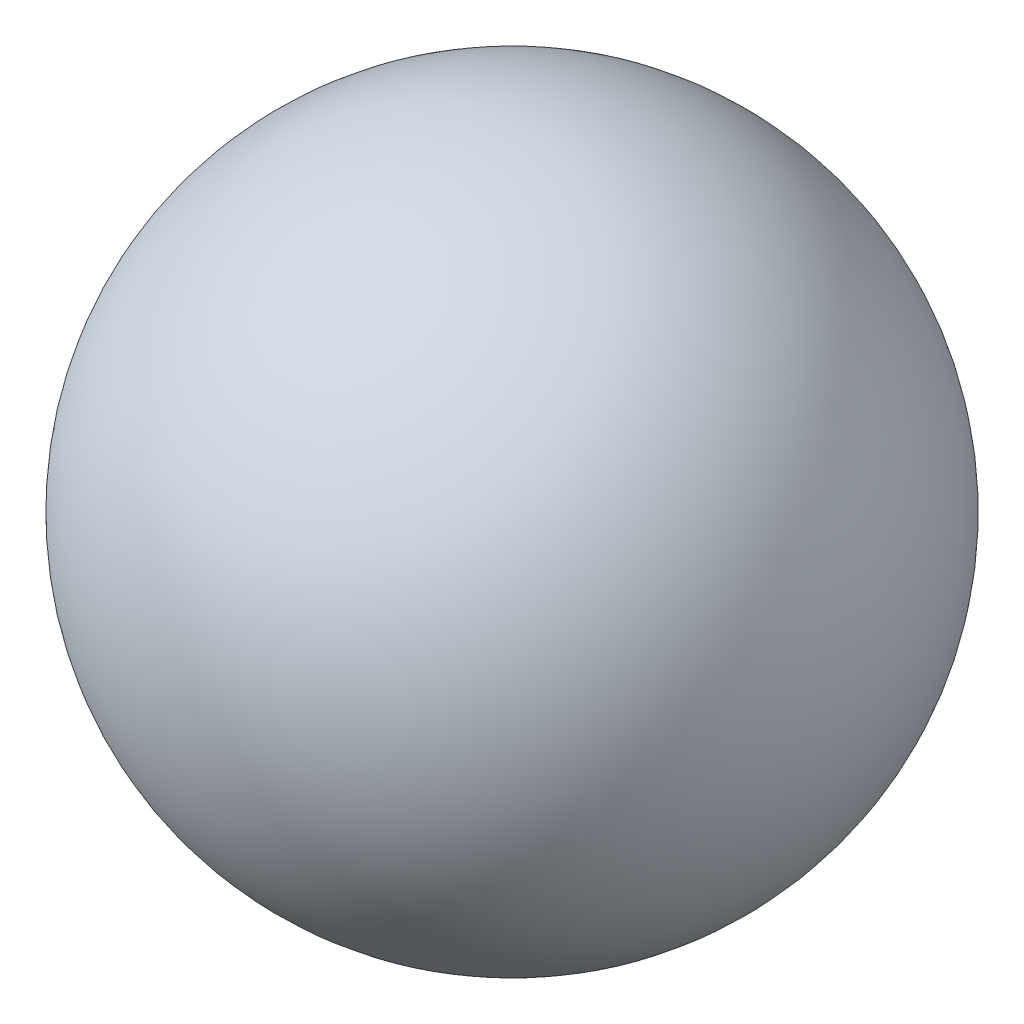
ISO-10303-21;
HEADER;
FILE_DESCRIPTION(('STEP AP214'),'2;1');
FILE_NAME('part.step','',(''),(''),'','','');
FILE_SCHEMA(('AUTOMOTIVE_DESIGN { 1 0 10303 214 1 1 1 1 }'));
ENDSEC;
DATA;
#1=APPLICATION_CONTEXT('core data for automotive mechanical design processes');
#2=APPLICATION_PROTOCOL_DEFINITION('international standard','automotive_design',2000,#1);
#3=PRODUCT_CONTEXT('',#1,'mechanical');
#4=PRODUCT('Part','Part','',(#3));
#5=PRODUCT_RELATED_PRODUCT_CATEGORY('part','',(#4));
#6=PRODUCT_DEFINITION_FORMATION('','',#4);
#7=PRODUCT_DEFINITION_CONTEXT('part definition',#1,'design');
#8=PRODUCT_DEFINITION('design','',#6,#7);
#9=PRODUCT_DEFINITION_SHAPE('','',#8);
#10=(LENGTH_UNIT() NAMED_UNIT(*) SI_UNIT(.MILLI.,.METRE.));
#11=(NAMED_UNIT(*) PLANE_ANGLE_UNIT() SI_UNIT($,.RADIAN.));
#12=(NAMED_UNIT(*) SI_UNIT($,.STERADIAN.) SOLID_ANGLE_UNIT());
#13=UNCERTAINTY_MEASURE_WITH_UNIT(LENGTH_MEASURE(1.E-05),#10,'distance_accuracy_value','');
#14=(GEOMETRIC_REPRESENTATION_CONTEXT(3) GLOBAL_UNCERTAINTY_ASSIGNED_CONTEXT((#13)) GLOBAL_UNIT_ASSIGNED_CONTEXT((#10,
#11,#12)) REPRESENTATION_CONTEXT('',''));
#15=CARTESIAN_POINT('',(0.,0.,0.));
#16=DIRECTION('',(0.,0.,1.));
#17=DIRECTION('',(1.,0.,0.));
#18=AXIS2_PLACEMENT_3D('',#15,#16,#17);
#19=CARTESIAN_POINT('',(0.,0.,0.));
#20=DIRECTION('',(0.,1.,0.));
#21=DIRECTION('',(1.,0.,0.));
#22=AXIS2_PLACEMENT_3D('',#19,#20,#21);
#23=SPHERICAL_SURFACE('',#22,367.6);
#24=CARTESIAN_POINT('',(0.,367.6,0.));
#25=VERTEX_POINT('',#24);
#26=VERTEX_LOOP('',#25);
#27=FACE_BOUND('',#26,.T.);
#28=ADVANCED_FACE('F29',(#27),#23,.T.);
#29=CLOSED_SHELL('',(#28));
#30=MANIFOLD_SOLID_BREP('B2',#29);
#31=ADVANCED_BREP_SHAPE_REPRESENTATION('',(#18,#30),#14);
#32=SHAPE_DEFINITION_REPRESENTATION(#9,#31);
ENDSEC;
END-ISO-10303-21;
